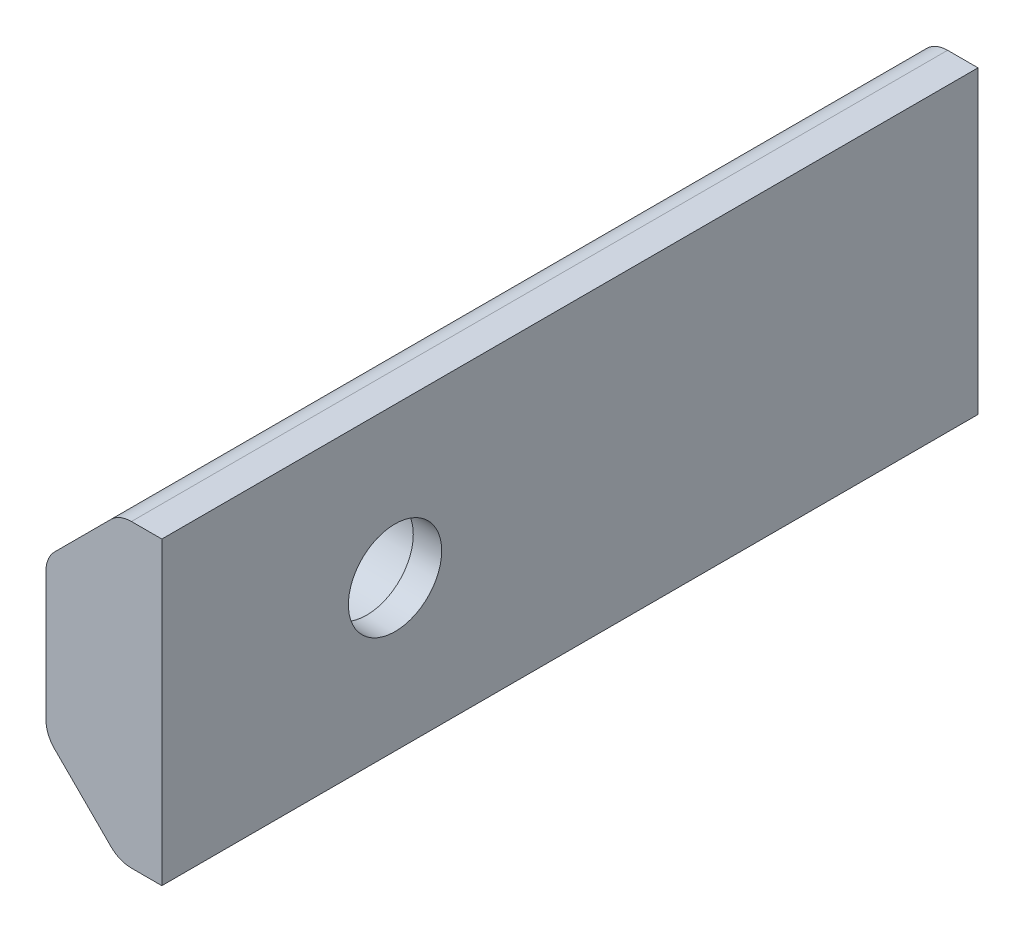
ISO-10303-21;
HEADER;
FILE_DESCRIPTION(('STEP AP214'),'2;1');
FILE_NAME('part.step','',(''),(''),'','','');
FILE_SCHEMA(('AUTOMOTIVE_DESIGN { 1 0 10303 214 1 1 1 1 }'));
ENDSEC;
DATA;
#1=APPLICATION_CONTEXT('core data for automotive mechanical design processes');
#2=APPLICATION_PROTOCOL_DEFINITION('international standard','automotive_design',2000,#1);
#3=PRODUCT_CONTEXT('',#1,'mechanical');
#4=PRODUCT('Part','Part','',(#3));
#5=PRODUCT_RELATED_PRODUCT_CATEGORY('part','',(#4));
#6=PRODUCT_DEFINITION_FORMATION('','',#4);
#7=PRODUCT_DEFINITION_CONTEXT('part definition',#1,'design');
#8=PRODUCT_DEFINITION('design','',#6,#7);
#9=PRODUCT_DEFINITION_SHAPE('','',#8);
#10=(LENGTH_UNIT() NAMED_UNIT(*) SI_UNIT(.MILLI.,.METRE.));
#11=(NAMED_UNIT(*) PLANE_ANGLE_UNIT() SI_UNIT($,.RADIAN.));
#12=(NAMED_UNIT(*) SI_UNIT($,.STERADIAN.) SOLID_ANGLE_UNIT());
#13=UNCERTAINTY_MEASURE_WITH_UNIT(LENGTH_MEASURE(1.E-05),#10,'distance_accuracy_value','');
#14=(GEOMETRIC_REPRESENTATION_CONTEXT(3) GLOBAL_UNCERTAINTY_ASSIGNED_CONTEXT((#13)) GLOBAL_UNIT_ASSIGNED_CONTEXT((#10,
#11,#12)) REPRESENTATION_CONTEXT('',''));
#15=CARTESIAN_POINT('',(0.,0.,0.));
#16=DIRECTION('',(0.,0.,1.));
#17=DIRECTION('',(1.,0.,0.));
#18=AXIS2_PLACEMENT_3D('',#15,#16,#17);
#19=CARTESIAN_POINT('',(-8.06619346294274,0.,20.));
#20=DIRECTION('',(1.,0.,0.));
#21=DIRECTION('',(0.,0.,-1.));
#22=AXIS2_PLACEMENT_3D('',#19,#20,#21);
#23=CYLINDRICAL_SURFACE('',#22,1.6);
#24=CARTESIAN_POINT('',(1.93380653705726,0.,20.));
#25=DIRECTION('',(1.,0.,0.));
#26=DIRECTION('',(0.,0.,-1.));
#27=AXIS2_PLACEMENT_3D('',#24,#25,#26);
#28=CIRCLE('',#27,1.6);
#29=CARTESIAN_POINT('',(1.93380653705726,0.,18.4));
#30=VERTEX_POINT('',#29);
#31=EDGE_CURVE('E140',#30,#30,#28,.T.);
#32=ORIENTED_EDGE('',*,*,#31,.T.);
#33=EDGE_LOOP('',(#32));
#34=FACE_BOUND('',#33,.T.);
#35=CARTESIAN_POINT('',(0.959641894022215,0.,20.));
#36=DIRECTION('',(-1.,0.,0.));
#37=DIRECTION('',(0.,0.,1.));
#38=AXIS2_PLACEMENT_3D('',#35,#36,#37);
#39=CIRCLE('',#38,1.6);
#40=CARTESIAN_POINT('',(0.959641894022215,0.,21.6));
#41=VERTEX_POINT('',#40);
#42=EDGE_CURVE('E138',#41,#41,#39,.F.);
#43=ORIENTED_EDGE('',*,*,#42,.F.);
#44=EDGE_LOOP('',(#43));
#45=FACE_BOUND('',#44,.T.);
#46=ADVANCED_FACE('F32',(#34,#45),#23,.F.);
#47=CARTESIAN_POINT('',(0.476512404632426,5.15,36.));
#48=DIRECTION('',(0.,-1.,0.));
#49=DIRECTION('',(0.,0.,-1.));
#50=AXIS2_PLACEMENT_3D('',#47,#48,#49);
#51=PLANE('',#50);
#52=DIRECTION('',(0.,0.,-1.));
#53=VECTOR('',#52,1.);
#54=CARTESIAN_POINT('',(0.890725967005521,5.15,36.));
#55=LINE('',#54,#53);
#56=CARTESIAN_POINT('',(0.890725967005521,5.15,0.));
#57=VERTEX_POINT('',#56);
#58=CARTESIAN_POINT('',(0.890725967005521,5.15,28.));
#59=VERTEX_POINT('',#58);
#60=EDGE_CURVE('E40',#57,#59,#55,.F.);
#61=ORIENTED_EDGE('',*,*,#60,.T.);
#62=DIRECTION('',(1.,0.,0.));
#63=VECTOR('',#62,1.);
#64=CARTESIAN_POINT('',(-8.06619346294274,5.15,28.));
#65=LINE('',#64,#63);
#66=CARTESIAN_POINT('',(1.93380653705726,5.15,28.));
#67=VERTEX_POINT('',#66);
#68=EDGE_CURVE('E46',#59,#67,#65,.T.);
#69=ORIENTED_EDGE('',*,*,#68,.T.);
#70=DIRECTION('',(0.,0.,-1.));
#71=VECTOR('',#70,1.);
#72=CARTESIAN_POINT('',(1.93380653705726,5.15,36.));
#73=LINE('',#72,#71);
#74=CARTESIAN_POINT('',(1.93380653705726,5.15,0.));
#75=VERTEX_POINT('',#74);
#76=EDGE_CURVE('E124',#67,#75,#73,.T.);
#77=ORIENTED_EDGE('',*,*,#76,.T.);
#78=DIRECTION('',(-1.,0.,0.));
#79=VECTOR('',#78,1.);
#80=CARTESIAN_POINT('',(0.476512404632426,5.15,0.));
#81=LINE('',#80,#79);
#82=EDGE_CURVE('E169',#75,#57,#81,.T.);
#83=ORIENTED_EDGE('',*,*,#82,.T.);
#84=EDGE_LOOP('',(#61,#69,#77,#83));
#85=FACE_BOUND('',#84,.T.);
#86=ADVANCED_FACE('F167',(#85),#51,.F.);
#87=CARTESIAN_POINT('',(-2.04035810597779,2.63312948938979,36.));
#88=DIRECTION('',(0.707106781186547,-0.707106781186547,0.));
#89=DIRECTION('',(0.707106781186548,0.707106781186548,0.));
#90=AXIS2_PLACEMENT_3D('',#87,#88,#89);
#91=PLANE('',#90);
#92=DIRECTION('',(0.,0.,-1.));
#93=VECTOR('',#92,1.);
#94=CARTESIAN_POINT('',(-1.74746488716433,2.92602270820324,36.));
#95=LINE('',#94,#93);
#96=CARTESIAN_POINT('',(-1.74746488716433,2.92602270820324,0.));
#97=VERTEX_POINT('',#96);
#98=CARTESIAN_POINT('',(-1.74746488716433,2.92602270820324,28.));
#99=VERTEX_POINT('',#98);
#100=EDGE_CURVE('E161',#97,#99,#95,.F.);
#101=ORIENTED_EDGE('',*,*,#100,.T.);
#102=DIRECTION('',(0.707106781186548,0.707106781186548,0.));
#103=VECTOR('',#102,1.);
#104=CARTESIAN_POINT('',(-2.04035810597779,2.63312948938979,28.));
#105=LINE('',#104,#103);
#106=CARTESIAN_POINT('',(0.183619185818973,4.85710678118655,28.));
#107=VERTEX_POINT('',#106);
#108=EDGE_CURVE('E174',#99,#107,#105,.T.);
#109=ORIENTED_EDGE('',*,*,#108,.T.);
#110=DIRECTION('',(0.,0.,-1.));
#111=VECTOR('',#110,1.);
#112=CARTESIAN_POINT('',(0.183619185818973,4.85710678118655,36.));
#113=LINE('',#112,#111);
#114=CARTESIAN_POINT('',(0.183619185818973,4.85710678118655,0.));
#115=VERTEX_POINT('',#114);
#116=EDGE_CURVE('E159',#107,#115,#113,.T.);
#117=ORIENTED_EDGE('',*,*,#116,.T.);
#118=DIRECTION('',(-0.707106781186547,-0.707106781186547,0.));
#119=VECTOR('',#118,1.);
#120=CARTESIAN_POINT('',(-2.04035810597779,2.63312948938979,0.));
#121=LINE('',#120,#119);
#122=EDGE_CURVE('E201',#115,#97,#121,.T.);
#123=ORIENTED_EDGE('',*,*,#122,.T.);
#124=EDGE_LOOP('',(#101,#109,#117,#123));
#125=FACE_BOUND('',#124,.T.);
#126=ADVANCED_FACE('F177',(#125),#91,.F.);
#127=CARTESIAN_POINT('',(-2.04035810597779,-2.63312948938979,36.));
#128=DIRECTION('',(1.,0.,0.));
#129=DIRECTION('',(0.,0.,-1.));
#130=AXIS2_PLACEMENT_3D('',#127,#128,#129);
#131=PLANE('',#130);
#132=CARTESIAN_POINT('',(-2.04035810597779,0.,20.));
#133=DIRECTION('',(-1.,0.,0.));
#134=DIRECTION('',(0.,0.,1.));
#135=AXIS2_PLACEMENT_3D('',#132,#133,#134);
#136=CIRCLE('',#135,1.95);
#137=CARTESIAN_POINT('',(-2.04035810597779,0.,21.95));
#138=VERTEX_POINT('',#137);
#139=EDGE_CURVE('E193',#138,#138,#136,.T.);
#140=ORIENTED_EDGE('',*,*,#139,.F.);
#141=EDGE_LOOP('',(#140));
#142=FACE_BOUND('',#141,.T.);
#143=DIRECTION('',(0.,0.,-1.));
#144=VECTOR('',#143,1.);
#145=CARTESIAN_POINT('',(-2.04035810597779,-2.21891592701669,36.));
#146=LINE('',#145,#144);
#147=CARTESIAN_POINT('',(-2.04035810597779,-2.21891592701669,0.));
#148=VERTEX_POINT('',#147);
#149=CARTESIAN_POINT('',(-2.04035810597779,-2.21891592701669,28.));
#150=VERTEX_POINT('',#149);
#151=EDGE_CURVE('E156',#148,#150,#146,.F.);
#152=ORIENTED_EDGE('',*,*,#151,.T.);
#153=DIRECTION('',(0.,1.,0.));
#154=VECTOR('',#153,1.);
#155=CARTESIAN_POINT('',(-2.04035810597779,-2.63312948938979,28.));
#156=LINE('',#155,#154);
#157=CARTESIAN_POINT('',(-2.04035810597779,2.21891592701669,28.));
#158=VERTEX_POINT('',#157);
#159=EDGE_CURVE('E181',#150,#158,#156,.T.);
#160=ORIENTED_EDGE('',*,*,#159,.T.);
#161=DIRECTION('',(0.,0.,-1.));
#162=VECTOR('',#161,1.);
#163=CARTESIAN_POINT('',(-2.04035810597779,2.21891592701669,36.));
#164=LINE('',#163,#162);
#165=CARTESIAN_POINT('',(-2.04035810597779,2.21891592701669,0.));
#166=VERTEX_POINT('',#165);
#167=EDGE_CURVE('E154',#158,#166,#164,.T.);
#168=ORIENTED_EDGE('',*,*,#167,.T.);
#169=DIRECTION('',(0.,-1.,0.));
#170=VECTOR('',#169,1.);
#171=CARTESIAN_POINT('',(-2.04035810597779,-2.63312948938979,0.));
#172=LINE('',#171,#170);
#173=EDGE_CURVE('E203',#166,#148,#172,.T.);
#174=ORIENTED_EDGE('',*,*,#173,.T.);
#175=EDGE_LOOP('',(#152,#160,#168,#174));
#176=FACE_BOUND('',#175,.T.);
#177=ADVANCED_FACE('F215',(#142,#176),#131,.F.);
#178=CARTESIAN_POINT('',(0.476512404632426,-5.15,36.));
#179=DIRECTION('',(0.707106781186547,0.707106781186547,0.));
#180=DIRECTION('',(-0.707106781186548,0.707106781186548,0.));
#181=AXIS2_PLACEMENT_3D('',#178,#179,#180);
#182=PLANE('',#181);
#183=DIRECTION('',(0.,0.,-1.));
#184=VECTOR('',#183,1.);
#185=CARTESIAN_POINT('',(0.183619185818973,-4.85710678118655,36.));
#186=LINE('',#185,#184);
#187=CARTESIAN_POINT('',(0.183619185818973,-4.85710678118655,0.));
#188=VERTEX_POINT('',#187);
#189=CARTESIAN_POINT('',(0.183619185818973,-4.85710678118655,28.));
#190=VERTEX_POINT('',#189);
#191=EDGE_CURVE('E151',#188,#190,#186,.F.);
#192=ORIENTED_EDGE('',*,*,#191,.T.);
#193=DIRECTION('',(-0.707106781186548,0.707106781186548,0.));
#194=VECTOR('',#193,1.);
#195=CARTESIAN_POINT('',(0.476512404632426,-5.15,28.));
#196=LINE('',#195,#194);
#197=CARTESIAN_POINT('',(-1.74746488716433,-2.92602270820324,28.));
#198=VERTEX_POINT('',#197);
#199=EDGE_CURVE('E189',#190,#198,#196,.T.);
#200=ORIENTED_EDGE('',*,*,#199,.T.);
#201=DIRECTION('',(0.,0.,-1.));
#202=VECTOR('',#201,1.);
#203=CARTESIAN_POINT('',(-1.74746488716433,-2.92602270820324,36.));
#204=LINE('',#203,#202);
#205=CARTESIAN_POINT('',(-1.74746488716433,-2.92602270820324,0.));
#206=VERTEX_POINT('',#205);
#207=EDGE_CURVE('E149',#198,#206,#204,.T.);
#208=ORIENTED_EDGE('',*,*,#207,.T.);
#209=DIRECTION('',(0.707106781186547,-0.707106781186547,0.));
#210=VECTOR('',#209,1.);
#211=CARTESIAN_POINT('',(0.476512404632426,-5.15,0.));
#212=LINE('',#211,#210);
#213=EDGE_CURVE('E206',#206,#188,#212,.T.);
#214=ORIENTED_EDGE('',*,*,#213,.T.);
#215=EDGE_LOOP('',(#192,#200,#208,#214));
#216=FACE_BOUND('',#215,.T.);
#217=ADVANCED_FACE('F223',(#216),#182,.F.);
#218=CARTESIAN_POINT('',(1.93380653705726,-5.15,36.));
#219=DIRECTION('',(0.,1.,0.));
#220=DIRECTION('',(0.,0.,1.));
#221=AXIS2_PLACEMENT_3D('',#218,#219,#220);
#222=PLANE('',#221);
#223=DIRECTION('',(0.,0.,-1.));
#224=VECTOR('',#223,1.);
#225=CARTESIAN_POINT('',(1.93380653705726,-5.15,36.));
#226=LINE('',#225,#224);
#227=CARTESIAN_POINT('',(1.93380653705726,-5.15,28.));
#228=VERTEX_POINT('',#227);
#229=CARTESIAN_POINT('',(1.93380653705726,-5.15,0.));
#230=VERTEX_POINT('',#229);
#231=EDGE_CURVE('E122',#228,#230,#226,.T.);
#232=ORIENTED_EDGE('',*,*,#231,.F.);
#233=DIRECTION('',(1.,0.,0.));
#234=VECTOR('',#233,1.);
#235=CARTESIAN_POINT('',(-8.06619346294274,-5.15,28.));
#236=LINE('',#235,#234);
#237=CARTESIAN_POINT('',(0.890725967005521,-5.15,28.));
#238=VERTEX_POINT('',#237);
#239=EDGE_CURVE('E108',#238,#228,#236,.T.);
#240=ORIENTED_EDGE('',*,*,#239,.F.);
#241=DIRECTION('',(0.,0.,-1.));
#242=VECTOR('',#241,1.);
#243=CARTESIAN_POINT('',(0.890725967005521,-5.15,36.));
#244=LINE('',#243,#242);
#245=CARTESIAN_POINT('',(0.890725967005521,-5.15,0.));
#246=VERTEX_POINT('',#245);
#247=EDGE_CURVE('E130',#238,#246,#244,.T.);
#248=ORIENTED_EDGE('',*,*,#247,.T.);
#249=DIRECTION('',(1.,0.,0.));
#250=VECTOR('',#249,1.);
#251=CARTESIAN_POINT('',(1.93380653705726,-5.15,0.));
#252=LINE('',#251,#250);
#253=EDGE_CURVE('E128',#246,#230,#252,.T.);
#254=ORIENTED_EDGE('',*,*,#253,.T.);
#255=EDGE_LOOP('',(#232,#240,#248,#254));
#256=FACE_BOUND('',#255,.T.);
#257=ADVANCED_FACE('F126',(#256),#222,.F.);
#258=CARTESIAN_POINT('',(1.93380653705726,5.15,36.));
#259=DIRECTION('',(-1.,0.,0.));
#260=DIRECTION('',(0.,0.,1.));
#261=AXIS2_PLACEMENT_3D('',#258,#259,#260);
#262=PLANE('',#261);
#263=ORIENTED_EDGE('',*,*,#31,.F.);
#264=EDGE_LOOP('',(#263));
#265=FACE_BOUND('',#264,.T.);
#266=ORIENTED_EDGE('',*,*,#76,.F.);
#267=DIRECTION('',(0.,1.,0.));
#268=VECTOR('',#267,1.);
#269=CARTESIAN_POINT('',(1.93380653705726,5.15,28.));
#270=LINE('',#269,#268);
#271=EDGE_CURVE('E111',#228,#67,#270,.T.);
#272=ORIENTED_EDGE('',*,*,#271,.F.);
#273=ORIENTED_EDGE('',*,*,#231,.T.);
#274=DIRECTION('',(0.,1.,0.));
#275=VECTOR('',#274,1.);
#276=CARTESIAN_POINT('',(1.93380653705726,5.15,0.));
#277=LINE('',#276,#275);
#278=EDGE_CURVE('E134',#230,#75,#277,.T.);
#279=ORIENTED_EDGE('',*,*,#278,.T.);
#280=EDGE_LOOP('',(#266,#272,#273,#279));
#281=FACE_BOUND('',#280,.T.);
#282=ADVANCED_FACE('F120',(#265,#281),#262,.F.);
#283=CARTESIAN_POINT('',(0.,0.,0.));
#284=DIRECTION('',(0.,0.,-1.));
#285=DIRECTION('',(-1.,0.,0.));
#286=AXIS2_PLACEMENT_3D('',#283,#284,#285);
#287=PLANE('',#286);
#288=ORIENTED_EDGE('',*,*,#253,.F.);
#289=CARTESIAN_POINT('',(0.890725967005521,-4.15,0.));
#290=DIRECTION('',(0.,0.,-1.));
#291=DIRECTION('',(-1.,0.,0.));
#292=AXIS2_PLACEMENT_3D('',#289,#290,#291);
#293=CIRCLE('',#292,1.);
#294=EDGE_CURVE('E147',#246,#188,#293,.T.);
#295=ORIENTED_EDGE('',*,*,#294,.T.);
#296=ORIENTED_EDGE('',*,*,#213,.F.);
#297=CARTESIAN_POINT('',(-1.04035810597779,-2.21891592701669,0.));
#298=DIRECTION('',(0.,0.,-1.));
#299=DIRECTION('',(-1.,0.,0.));
#300=AXIS2_PLACEMENT_3D('',#297,#298,#299);
#301=CIRCLE('',#300,1.);
#302=EDGE_CURVE('E145',#206,#148,#301,.T.);
#303=ORIENTED_EDGE('',*,*,#302,.T.);
#304=ORIENTED_EDGE('',*,*,#173,.F.);
#305=CARTESIAN_POINT('',(-1.04035810597779,2.21891592701669,0.));
#306=DIRECTION('',(0.,0.,-1.));
#307=DIRECTION('',(-1.,0.,0.));
#308=AXIS2_PLACEMENT_3D('',#305,#306,#307);
#309=CIRCLE('',#308,1.);
#310=EDGE_CURVE('E54',#166,#97,#309,.T.);
#311=ORIENTED_EDGE('',*,*,#310,.T.);
#312=ORIENTED_EDGE('',*,*,#122,.F.);
#313=CARTESIAN_POINT('',(0.890725967005521,4.15,0.));
#314=DIRECTION('',(0.,0.,-1.));
#315=DIRECTION('',(-1.,0.,0.));
#316=AXIS2_PLACEMENT_3D('',#313,#314,#315);
#317=CIRCLE('',#316,1.);
#318=EDGE_CURVE('E132',#115,#57,#317,.T.);
#319=ORIENTED_EDGE('',*,*,#318,.T.);
#320=ORIENTED_EDGE('',*,*,#82,.F.);
#321=ORIENTED_EDGE('',*,*,#278,.F.);
#322=EDGE_LOOP('',(#288,#295,#296,#303,#304,#311,#312,#319,#320,#321));
#323=FACE_BOUND('',#322,.T.);
#324=ADVANCED_FACE('F209',(#323),#287,.T.);
#325=CARTESIAN_POINT('',(0.959641894022214,0.,20.));
#326=DIRECTION('',(-1.,0.,0.));
#327=DIRECTION('',(0.,0.,1.));
#328=AXIS2_PLACEMENT_3D('',#325,#326,#327);
#329=PLANE('',#328);
#330=CARTESIAN_POINT('',(0.959641894022214,0.,20.));
#331=DIRECTION('',(-1.,0.,0.));
#332=DIRECTION('',(0.,0.,1.));
#333=AXIS2_PLACEMENT_3D('',#330,#331,#332);
#334=CIRCLE('',#333,1.95);
#335=CARTESIAN_POINT('',(0.959641894022214,0.,21.95));
#336=VERTEX_POINT('',#335);
#337=EDGE_CURVE('E141',#336,#336,#334,.T.);
#338=ORIENTED_EDGE('',*,*,#337,.T.);
#339=EDGE_LOOP('',(#338));
#340=FACE_BOUND('',#339,.T.);
#341=ORIENTED_EDGE('',*,*,#42,.T.);
#342=EDGE_LOOP('',(#341));
#343=FACE_BOUND('',#342,.T.);
#344=ADVANCED_FACE('F236',(#340,#343),#329,.T.);
#345=CARTESIAN_POINT('',(0.959641894022214,0.,20.));
#346=DIRECTION('',(-1.,0.,0.));
#347=DIRECTION('',(0.,0.,1.));
#348=AXIS2_PLACEMENT_3D('',#345,#346,#347);
#349=CYLINDRICAL_SURFACE('',#348,1.95);
#350=ORIENTED_EDGE('',*,*,#337,.F.);
#351=EDGE_LOOP('',(#350));
#352=FACE_BOUND('',#351,.T.);
#353=ORIENTED_EDGE('',*,*,#139,.T.);
#354=EDGE_LOOP('',(#353));
#355=FACE_BOUND('',#354,.T.);
#356=ADVANCED_FACE('F229',(#352,#355),#349,.F.);
#357=CARTESIAN_POINT('',(0.890725967005521,-4.15,36.));
#358=DIRECTION('',(0.,0.,-1.));
#359=DIRECTION('',(-1.,0.,0.));
#360=AXIS2_PLACEMENT_3D('',#357,#358,#359);
#361=CYLINDRICAL_SURFACE('',#360,1.);
#362=CARTESIAN_POINT('',(0.890725967005521,-4.15,28.));
#363=DIRECTION('',(0.,0.,-1.));
#364=DIRECTION('',(-1.,0.,0.));
#365=AXIS2_PLACEMENT_3D('',#362,#363,#364);
#366=CIRCLE('',#365,1.);
#367=EDGE_CURVE('E113',#190,#238,#366,.F.);
#368=ORIENTED_EDGE('',*,*,#367,.F.);
#369=ORIENTED_EDGE('',*,*,#191,.F.);
#370=ORIENTED_EDGE('',*,*,#294,.F.);
#371=ORIENTED_EDGE('',*,*,#247,.F.);
#372=EDGE_LOOP('',(#368,#369,#370,#371));
#373=FACE_BOUND('',#372,.T.);
#374=ADVANCED_FACE('F227',(#373),#361,.T.);
#375=CARTESIAN_POINT('',(-1.04035810597779,-2.21891592701669,36.));
#376=DIRECTION('',(0.,0.,-1.));
#377=DIRECTION('',(-1.,0.,0.));
#378=AXIS2_PLACEMENT_3D('',#375,#376,#377);
#379=CYLINDRICAL_SURFACE('',#378,1.);
#380=CARTESIAN_POINT('',(-1.04035810597779,-2.21891592701669,28.));
#381=DIRECTION('',(0.,0.,-1.));
#382=DIRECTION('',(-1.,0.,0.));
#383=AXIS2_PLACEMENT_3D('',#380,#381,#382);
#384=CIRCLE('',#383,1.);
#385=EDGE_CURVE('E187',#150,#198,#384,.F.);
#386=ORIENTED_EDGE('',*,*,#385,.F.);
#387=ORIENTED_EDGE('',*,*,#151,.F.);
#388=ORIENTED_EDGE('',*,*,#302,.F.);
#389=ORIENTED_EDGE('',*,*,#207,.F.);
#390=EDGE_LOOP('',(#386,#387,#388,#389));
#391=FACE_BOUND('',#390,.T.);
#392=ADVANCED_FACE('F219',(#391),#379,.T.);
#393=CARTESIAN_POINT('',(-1.04035810597779,2.21891592701669,36.));
#394=DIRECTION('',(0.,0.,-1.));
#395=DIRECTION('',(-1.,0.,0.));
#396=AXIS2_PLACEMENT_3D('',#393,#394,#395);
#397=CYLINDRICAL_SURFACE('',#396,1.);
#398=CARTESIAN_POINT('',(-1.04035810597779,2.21891592701669,28.));
#399=DIRECTION('',(0.,0.,-1.));
#400=DIRECTION('',(-1.,0.,0.));
#401=AXIS2_PLACEMENT_3D('',#398,#399,#400);
#402=CIRCLE('',#401,1.);
#403=EDGE_CURVE('E179',#99,#158,#402,.F.);
#404=ORIENTED_EDGE('',*,*,#403,.F.);
#405=ORIENTED_EDGE('',*,*,#100,.F.);
#406=ORIENTED_EDGE('',*,*,#310,.F.);
#407=ORIENTED_EDGE('',*,*,#167,.F.);
#408=EDGE_LOOP('',(#404,#405,#406,#407));
#409=FACE_BOUND('',#408,.T.);
#410=ADVANCED_FACE('F211',(#409),#397,.T.);
#411=CARTESIAN_POINT('',(0.890725967005521,4.15,36.));
#412=DIRECTION('',(0.,0.,-1.));
#413=DIRECTION('',(-1.,0.,0.));
#414=AXIS2_PLACEMENT_3D('',#411,#412,#413);
#415=CYLINDRICAL_SURFACE('',#414,1.);
#416=CARTESIAN_POINT('',(0.890725967005521,4.15,28.));
#417=DIRECTION('',(0.,0.,-1.));
#418=DIRECTION('',(-1.,0.,0.));
#419=AXIS2_PLACEMENT_3D('',#416,#417,#418);
#420=CIRCLE('',#419,1.);
#421=EDGE_CURVE('E11',#59,#107,#420,.F.);
#422=ORIENTED_EDGE('',*,*,#421,.F.);
#423=ORIENTED_EDGE('',*,*,#60,.F.);
#424=ORIENTED_EDGE('',*,*,#318,.F.);
#425=ORIENTED_EDGE('',*,*,#116,.F.);
#426=EDGE_LOOP('',(#422,#423,#424,#425));
#427=FACE_BOUND('',#426,.T.);
#428=ADVANCED_FACE('F34',(#427),#415,.T.);
#429=CARTESIAN_POINT('',(-8.06619346294274,5.15,28.));
#430=DIRECTION('',(0.,0.,-1.));
#431=DIRECTION('',(-1.,0.,0.));
#432=AXIS2_PLACEMENT_3D('',#429,#430,#431);
#433=PLANE('',#432);
#434=ORIENTED_EDGE('',*,*,#367,.T.);
#435=ORIENTED_EDGE('',*,*,#239,.T.);
#436=ORIENTED_EDGE('',*,*,#271,.T.);
#437=ORIENTED_EDGE('',*,*,#68,.F.);
#438=ORIENTED_EDGE('',*,*,#421,.T.);
#439=ORIENTED_EDGE('',*,*,#108,.F.);
#440=ORIENTED_EDGE('',*,*,#403,.T.);
#441=ORIENTED_EDGE('',*,*,#159,.F.);
#442=ORIENTED_EDGE('',*,*,#385,.T.);
#443=ORIENTED_EDGE('',*,*,#199,.F.);
#444=EDGE_LOOP('',(#434,#435,#436,#437,#438,#439,#440,#441,#442,#443));
#445=FACE_BOUND('',#444,.T.);
#446=ADVANCED_FACE('F110',(#445),#433,.F.);
#447=CLOSED_SHELL('',(#46,#86,#126,#177,#217,#257,#282,#324,#344,#356,#374,#392,#410,#428,#446));
#448=MANIFOLD_SOLID_BREP('B2',#447);
#449=ADVANCED_BREP_SHAPE_REPRESENTATION('',(#18,#448),#14);
#450=SHAPE_DEFINITION_REPRESENTATION(#9,#449);
ENDSEC;
END-ISO-10303-21;
